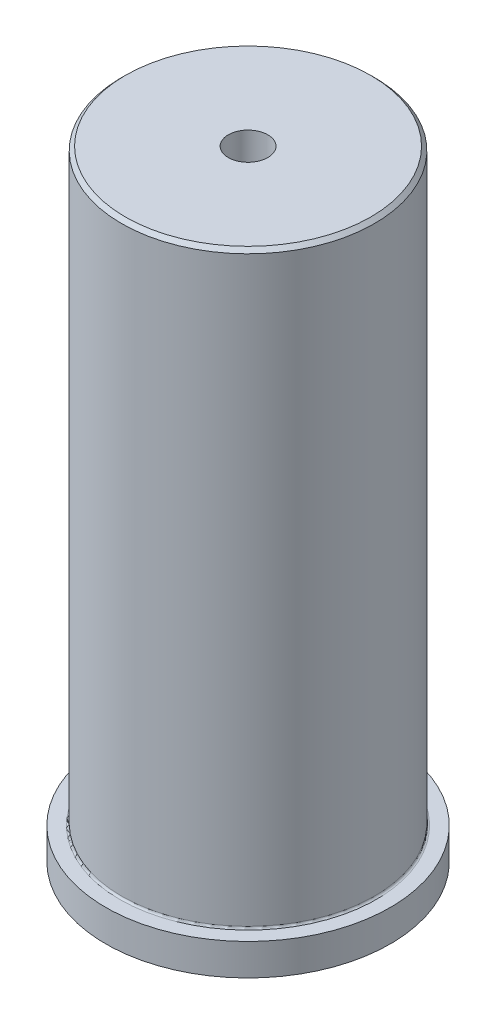
ISO-10303-21;
HEADER;
FILE_DESCRIPTION(('STEP AP214'),'2;1');
FILE_NAME('part.step','',(''),(''),'','','');
FILE_SCHEMA(('AUTOMOTIVE_DESIGN { 1 0 10303 214 1 1 1 1 }'));
ENDSEC;
DATA;
#1=APPLICATION_CONTEXT('core data for automotive mechanical design processes');
#2=APPLICATION_PROTOCOL_DEFINITION('international standard','automotive_design',2000,#1);
#3=PRODUCT_CONTEXT('',#1,'mechanical');
#4=PRODUCT('Part','Part','',(#3));
#5=PRODUCT_RELATED_PRODUCT_CATEGORY('part','',(#4));
#6=PRODUCT_DEFINITION_FORMATION('','',#4);
#7=PRODUCT_DEFINITION_CONTEXT('part definition',#1,'design');
#8=PRODUCT_DEFINITION('design','',#6,#7);
#9=PRODUCT_DEFINITION_SHAPE('','',#8);
#10=(LENGTH_UNIT() NAMED_UNIT(*) SI_UNIT(.MILLI.,.METRE.));
#11=(NAMED_UNIT(*) PLANE_ANGLE_UNIT() SI_UNIT($,.RADIAN.));
#12=(NAMED_UNIT(*) SI_UNIT($,.STERADIAN.) SOLID_ANGLE_UNIT());
#13=UNCERTAINTY_MEASURE_WITH_UNIT(LENGTH_MEASURE(1.E-05),#10,'distance_accuracy_value','');
#14=(GEOMETRIC_REPRESENTATION_CONTEXT(3) GLOBAL_UNCERTAINTY_ASSIGNED_CONTEXT((#13)) GLOBAL_UNIT_ASSIGNED_CONTEXT((#10,
#11,#12)) REPRESENTATION_CONTEXT('',''));
#15=CARTESIAN_POINT('',(0.,0.,0.));
#16=DIRECTION('',(0.,0.,1.));
#17=DIRECTION('',(1.,0.,0.));
#18=AXIS2_PLACEMENT_3D('',#15,#16,#17);
#19=CARTESIAN_POINT('',(0.,0.,0.));
#20=DIRECTION('',(0.,-1.,0.));
#21=DIRECTION('',(0.,0.,-1.));
#22=AXIS2_PLACEMENT_3D('',#19,#20,#21);
#23=PLANE('',#22);
#24=CARTESIAN_POINT('',(0.,0.,0.));
#25=DIRECTION('',(0.,-1.,0.));
#26=DIRECTION('',(0.,0.,-1.));
#27=AXIS2_PLACEMENT_3D('',#24,#25,#26);
#28=CIRCLE('',#27,28.575);
#29=CARTESIAN_POINT('',(0.,0.,-28.575));
#30=VERTEX_POINT('',#29);
#31=EDGE_CURVE('E83',#30,#30,#28,.T.);
#32=ORIENTED_EDGE('',*,*,#31,.T.);
#33=EDGE_LOOP('',(#32));
#34=FACE_BOUND('',#33,.T.);
#35=ADVANCED_FACE('F35',(#34),#23,.T.);
#36=CARTESIAN_POINT('',(0.,0.,0.));
#37=DIRECTION('',(0.,-1.,0.));
#38=DIRECTION('',(0.,0.,-1.));
#39=AXIS2_PLACEMENT_3D('',#36,#37,#38);
#40=CYLINDRICAL_SURFACE('',#39,28.575);
#41=CARTESIAN_POINT('',(0.,6.35,0.));
#42=DIRECTION('',(0.,-1.,0.));
#43=DIRECTION('',(0.,0.,-1.));
#44=AXIS2_PLACEMENT_3D('',#41,#42,#43);
#45=CIRCLE('',#44,28.575);
#46=CARTESIAN_POINT('',(0.,6.35,-28.575));
#47=VERTEX_POINT('',#46);
#48=EDGE_CURVE('E73',#47,#47,#45,.T.);
#49=ORIENTED_EDGE('',*,*,#48,.T.);
#50=EDGE_LOOP('',(#49));
#51=FACE_BOUND('',#50,.T.);
#52=ORIENTED_EDGE('',*,*,#31,.F.);
#53=EDGE_LOOP('',(#52));
#54=FACE_BOUND('',#53,.T.);
#55=ADVANCED_FACE('F108',(#51,#54),#40,.T.);
#56=CARTESIAN_POINT('',(28.575,6.35,0.));
#57=DIRECTION('',(0.,1.,0.));
#58=DIRECTION('',(0.,0.,1.));
#59=AXIS2_PLACEMENT_3D('',#56,#57,#58);
#60=PLANE('',#59);
#61=CARTESIAN_POINT('',(0.,6.35,0.));
#62=DIRECTION('',(0.,1.,0.));
#63=DIRECTION('',(0.,0.,1.));
#64=AXIS2_PLACEMENT_3D('',#61,#62,#63);
#65=CIRCLE('',#64,25.781);
#66=CARTESIAN_POINT('',(0.,6.35,25.781));
#67=VERTEX_POINT('',#66);
#68=EDGE_CURVE('E92',#67,#67,#65,.F.);
#69=ORIENTED_EDGE('',*,*,#68,.T.);
#70=EDGE_LOOP('',(#69));
#71=FACE_BOUND('',#70,.T.);
#72=ORIENTED_EDGE('',*,*,#48,.F.);
#73=EDGE_LOOP('',(#72));
#74=FACE_BOUND('',#73,.T.);
#75=ADVANCED_FACE('F105',(#71,#74),#60,.T.);
#76=CARTESIAN_POINT('',(0.,0.,0.));
#77=DIRECTION('',(0.,-1.,0.));
#78=DIRECTION('',(0.,0.,-1.));
#79=AXIS2_PLACEMENT_3D('',#76,#77,#78);
#80=CYLINDRICAL_SURFACE('',#79,25.4);
#81=CARTESIAN_POINT('',(0.,96.5073,-25.4));
#82=CARTESIAN_POINT('',(0.0890772815516551,96.5072960806031,-25.3999993405078));
#83=CARTESIAN_POINT('',(0.178216934422193,96.4997773935456,-25.3995264004062));
#84=CARTESIAN_POINT('',(0.354034892257721,96.4698917787592,-25.3976852164307));
#85=CARTESIAN_POINT('',(0.440710209847181,96.4475075690208,-25.3963159305306));
#86=CARTESIAN_POINT('',(0.609027315874058,96.3885363455029,-25.3928369579348));
#87=CARTESIAN_POINT('',(0.69067173322489,96.3519568237269,-25.3907276618579));
#88=CARTESIAN_POINT('',(0.846640273798179,96.2656454787975,-25.3860059056847));
#89=CARTESIAN_POINT('',(0.920966068158769,96.215916667762,-25.3833935608593));
#90=CARTESIAN_POINT('',(1.06032018908115,96.104636733557,-25.3779549712506));
#91=CARTESIAN_POINT('',(1.12533611013224,96.0430700874601,-25.375128448598));
#92=CARTESIAN_POINT('',(1.24411883695699,95.9098941153553,-25.3695824409509));
#93=CARTESIAN_POINT('',(1.29788517266755,95.838284369906,-25.3668629604329));
#94=CARTESIAN_POINT('',(1.3926807081512,95.6869847096737,-25.3618355765534));
#95=CARTESIAN_POINT('',(1.43369960395146,95.6072883269854,-25.3595280067842));
#96=CARTESIAN_POINT('',(1.50176994858076,95.4421230244906,-25.355588265541));
#97=CARTESIAN_POINT('',(1.52882154762219,95.356654166776,-25.3539560868034));
#98=CARTESIAN_POINT('',(1.56815497696011,95.1824895560097,-25.3515538346627));
#99=CARTESIAN_POINT('',(1.58045623796135,95.093798207093,-25.3507826271897));
#100=CARTESIAN_POINT('',(1.58999978541007,94.9156063978836,-25.3501858903591));
#101=CARTESIAN_POINT('',(1.58724224240966,94.826105946766,-25.3503603502911));
#102=CARTESIAN_POINT('',(1.56676258410163,94.6489689242994,-25.3516342215337));
#103=CARTESIAN_POINT('',(1.54906149613709,94.5613299112334,-25.3527323331487));
#104=CARTESIAN_POINT('',(1.49922983151612,94.3902695359763,-25.3557277104486));
#105=CARTESIAN_POINT('',(1.46709916840193,94.3068481990596,-25.3576249809218));
#106=CARTESIAN_POINT('',(1.38929655485215,94.1465236536905,-25.3620063610172));
#107=CARTESIAN_POINT('',(1.34361506586004,94.0696250858746,-25.3644908837608));
#108=CARTESIAN_POINT('',(1.24001444407503,93.9245796839926,-25.369766364796));
#109=CARTESIAN_POINT('',(1.18209517370326,93.8564329483295,-25.3725573265326));
#110=CARTESIAN_POINT('',(1.05554467500541,93.7307033049213,-25.378136933608));
#111=CARTESIAN_POINT('',(0.986895248611048,93.6731387119199,-25.3809255667683));
#112=CARTESIAN_POINT('',(0.840896941222836,93.5703486728836,-25.3861816554736));
#113=CARTESIAN_POINT('',(0.763548057189617,93.5251232311597,-25.3886491109065));
#114=CARTESIAN_POINT('',(0.602335379939374,93.4482968309815,-25.3929849946973));
#115=CARTESIAN_POINT('',(0.518471255288405,93.4166965661839,-25.3948533925561));
#116=CARTESIAN_POINT('',(0.346613655752569,93.3680297708484,-25.3977802081714));
#117=CARTESIAN_POINT('',(0.258620229105691,93.3509630705757,-25.3988386353874));
#118=CARTESIAN_POINT('',(0.0811607430297941,93.3318705596317,-25.4000250223717));
#119=CARTESIAN_POINT('',(-0.00830258207145954,93.3298194271945,-25.4001545486009));
#120=CARTESIAN_POINT('',(-0.186302024601945,93.34075011428,-25.3994727044321));
#121=CARTESIAN_POINT('',(-0.274838146853901,93.353731855572,-25.3986613389306));
#122=CARTESIAN_POINT('',(-0.448398631876102,93.3943388195394,-25.3961900592131));
#123=CARTESIAN_POINT('',(-0.533425723141905,93.4219524246147,-25.3945308182418));
#124=CARTESIAN_POINT('',(-0.697638751545767,93.4910274669384,-25.3905504582616));
#125=CARTESIAN_POINT('',(-0.776824636139441,93.5324890287372,-25.3882293332997));
#126=CARTESIAN_POINT('',(-0.927223409402576,93.6281475014472,-25.3831821134134));
#127=CARTESIAN_POINT('',(-0.998425523422202,93.682361324072,-25.3804554824989));
#128=CARTESIAN_POINT('',(-1.13072712197349,93.801960770328,-25.3749058995054));
#129=CARTESIAN_POINT('',(-1.19182650702397,93.8673465039557,-25.3720829464783));
#130=CARTESIAN_POINT('',(-1.3022740345212,94.0075429566602,-25.3666543507824));
#131=CARTESIAN_POINT('',(-1.35160574926768,94.0823666310783,-25.3640490151651));
#132=CARTESIAN_POINT('',(-1.43700521668147,94.2392498773811,-25.3593543494529));
#133=CARTESIAN_POINT('',(-1.47307305114239,94.321309404641,-25.357265016176));
#134=CARTESIAN_POINT('',(-1.53089247905071,94.4902749837596,-25.3538401885538));
#135=CARTESIAN_POINT('',(-1.55265441218913,94.5771774859353,-25.352504149859));
#136=CARTESIAN_POINT('',(-1.58127806496944,94.7534114841111,-25.3507350685755));
#137=CARTESIAN_POINT('',(-1.58813993249528,94.8427429559946,-25.3503020170246));
#138=CARTESIAN_POINT('',(-1.58676724213198,95.0211357473517,-25.3503879628329));
#139=CARTESIAN_POINT('',(-1.57855851143023,95.1101972674954,-25.3509053314138));
#140=CARTESIAN_POINT('',(-1.54733118630569,95.2856747860797,-25.3528303653629));
#141=CARTESIAN_POINT('',(-1.52431256504968,95.3720907797266,-25.3542380323443));
#142=CARTESIAN_POINT('',(-1.46412468021325,95.5398281239225,-25.3577846332053));
#143=CARTESIAN_POINT('',(-1.42695551825154,95.6211495110523,-25.3599235618336));
#144=CARTESIAN_POINT('',(-1.3395252161022,95.7764008560819,-25.3646916102891));
#145=CARTESIAN_POINT('',(-1.28926441503038,95.8503310053701,-25.3673207174186));
#146=CARTESIAN_POINT('',(-1.17698211995936,95.9888322094471,-25.3727781000682));
#147=CARTESIAN_POINT('',(-1.11494196278718,96.0533881213252,-25.3756066871117));
#148=CARTESIAN_POINT('',(-0.980886959107157,96.1711911511266,-25.3811416437811));
#149=CARTESIAN_POINT('',(-0.908869675832013,96.2244354982923,-25.3838479833349));
#150=CARTESIAN_POINT('',(-0.756822725724815,96.318143200095,-25.3888362949521));
#151=CARTESIAN_POINT('',(-0.676783256004449,96.3585906602565,-25.3911177378344));
#152=CARTESIAN_POINT('',(-0.511093256064827,96.4254234449966,-25.3949920704623));
#153=CARTESIAN_POINT('',(-0.425449430168753,96.4518252387231,-25.396585766205));
#154=CARTESIAN_POINT('',(-0.282734715561966,96.4829552499224,-25.398487400356));
#155=CARTESIAN_POINT('',(-0.226586319292563,96.4920727261902,-25.3990521043383));
#156=CARTESIAN_POINT('',(-0.113633743516228,96.5042463472882,-25.3998086142742));
#157=CARTESIAN_POINT('',(-0.0568295649160699,96.5073025004986,-25.4000004207432));
#158=CARTESIAN_POINT('',(0.,96.5073,-25.4));
#159=B_SPLINE_CURVE_WITH_KNOTS('',3,(#81,#82,#83,#84,#85,#86,#87,#88,#89,#90,#91,#92,#93,#94,
#95,#96,#97,#98,#99,#100,#101,#102,#103,#104,#105,#106,#107,#108,#109,#110,#111,#112,#113,#114,
#115,#116,#117,#118,#119,#120,#121,#122,#123,#124,#125,#126,#127,#128,#129,#130,#131,#132,#133,
#134,#135,#136,#137,#138,#139,#140,#141,#142,#143,#144,#145,#146,#147,#148,#149,#150,#151,#152,
#153,#154,#155,#156,#157,#158),.UNSPECIFIED.,.T.,.F.,(4,2,2,2,2,2,2,2,2,2,2,2,2,2,2,2,2,2,2,2,2,
2,2,2,2,2,2,2,2,2,2,2,2,2,2,2,2,2,4),(0.,0.267024382982193,0.534359741586169,0.801554197373604,
1.06868749966621,1.33617351212228,1.60367069923104,1.87138354982984,2.13909352122966,
2.40645044796103,2.6738043466833,2.94078267254129,3.20776259807606,3.47493090110761,
3.74210220784267,4.0097316476512,4.27736118096278,4.54500433766488,4.81264436857103,
5.07983295582914,5.34702015264969,5.6139955218429,5.88097329231165,6.14830713797552,
6.41564361590886,6.6833511403882,6.95105701398333,7.21856918791958,7.48607870677128,
7.75313020994782,8.02018219698156,8.2872322662816,8.55427541880832,8.82174525868233,
9.08928053970249,9.35714682225784,9.62469832393475,9.79505489772018,9.9654112359753),.UNSPECIFIED.);
#160=CARTESIAN_POINT('',(0.,96.5073,-25.4));
#161=VERTEX_POINT('',#160);
#162=EDGE_CURVE('E67',#161,#161,#159,.T.);
#163=ORIENTED_EDGE('',*,*,#162,.F.);
#164=EDGE_LOOP('',(#163));
#165=FACE_BOUND('',#164,.T.);
#166=CARTESIAN_POINT('',(0.,6.731,0.));
#167=DIRECTION('',(0.,1.,0.));
#168=DIRECTION('',(0.,0.,1.));
#169=AXIS2_PLACEMENT_3D('',#166,#167,#168);
#170=CIRCLE('',#169,25.4);
#171=CARTESIAN_POINT('',(0.,6.731,25.4));
#172=VERTEX_POINT('',#171);
#173=EDGE_CURVE('E48',#172,#172,#170,.T.);
#174=ORIENTED_EDGE('',*,*,#173,.T.);
#175=EDGE_LOOP('',(#174));
#176=FACE_BOUND('',#175,.T.);
#177=CARTESIAN_POINT('',(0.,123.698,0.));
#178=DIRECTION('',(0.,1.,0.));
#179=DIRECTION('',(0.,0.,1.));
#180=AXIS2_PLACEMENT_3D('',#177,#178,#179);
#181=CIRCLE('',#180,25.4);
#182=CARTESIAN_POINT('',(0.,123.698,25.4));
#183=VERTEX_POINT('',#182);
#184=EDGE_CURVE('E86',#183,#183,#181,.F.);
#185=ORIENTED_EDGE('',*,*,#184,.T.);
#186=EDGE_LOOP('',(#185));
#187=FACE_BOUND('',#186,.T.);
#188=ADVANCED_FACE('F97',(#165,#176,#187),#80,.T.);
#189=CARTESIAN_POINT('',(25.4,124.46,0.));
#190=DIRECTION('',(0.,1.,0.));
#191=DIRECTION('',(0.,0.,1.));
#192=AXIS2_PLACEMENT_3D('',#189,#190,#191);
#193=PLANE('',#192);
#194=CARTESIAN_POINT('',(0.,124.46,0.));
#195=DIRECTION('',(0.,1.,0.));
#196=DIRECTION('',(0.,0.,1.));
#197=AXIS2_PLACEMENT_3D('',#194,#195,#196);
#198=CIRCLE('',#197,24.638);
#199=CARTESIAN_POINT('',(0.,124.46,24.638));
#200=VERTEX_POINT('',#199);
#201=EDGE_CURVE('E89',#200,#200,#198,.T.);
#202=ORIENTED_EDGE('',*,*,#201,.T.);
#203=EDGE_LOOP('',(#202));
#204=FACE_BOUND('',#203,.T.);
#205=CARTESIAN_POINT('',(0.,124.46,0.));
#206=DIRECTION('',(0.,1.,0.));
#207=DIRECTION('',(0.,0.,1.));
#208=AXIS2_PLACEMENT_3D('',#205,#206,#207);
#209=CIRCLE('',#208,3.96875);
#210=CARTESIAN_POINT('',(0.,124.46,3.96875));
#211=VERTEX_POINT('',#210);
#212=EDGE_CURVE('E70',#211,#211,#209,.T.);
#213=ORIENTED_EDGE('',*,*,#212,.F.);
#214=EDGE_LOOP('',(#213));
#215=FACE_BOUND('',#214,.T.);
#216=ADVANCED_FACE('F130',(#204,#215),#193,.T.);
#217=CARTESIAN_POINT('',(0.,124.46,0.));
#218=DIRECTION('',(0.,1.,0.));
#219=DIRECTION('',(0.,0.,1.));
#220=AXIS2_PLACEMENT_3D('',#217,#218,#219);
#221=CYLINDRICAL_SURFACE('',#220,3.96874999999999);
#222=CARTESIAN_POINT('',(0.,94.9198,0.));
#223=DIRECTION('',(0.,1.,0.));
#224=DIRECTION('',(0.,0.,1.));
#225=AXIS2_PLACEMENT_3D('',#222,#223,#224);
#226=CIRCLE('',#225,3.96874999999999);
#227=CARTESIAN_POINT('',(-1.5875,94.9198,-3.63741945787119));
#228=VERTEX_POINT('',#227);
#229=CARTESIAN_POINT('',(1.58750000000522,94.9198000000011,-3.63741945787102));
#230=VERTEX_POINT('',#229);
#231=EDGE_CURVE('E66',#228,#230,#226,.T.);
#232=ORIENTED_EDGE('',*,*,#231,.F.);
#233=CARTESIAN_POINT('',(-1.5875,94.9198,-3.63741945787119));
#234=CARTESIAN_POINT('',(-1.58750184763796,94.9625202346042,-3.63741384116569));
#235=CARTESIAN_POINT('',(-1.58577445725726,95.0052179154992,-3.63817300640441));
#236=CARTESIAN_POINT('',(-1.5788972457707,95.0902688017805,-3.64116482543655));
#237=CARTESIAN_POINT('',(-1.5737487281427,95.1326221321483,-3.64339691803017));
#238=CARTESIAN_POINT('',(-1.55328918259186,95.2583622530961,-3.65219121167938));
#239=CARTESIAN_POINT('',(-1.53296334513986,95.3408444249451,-3.66085250980029));
#240=CARTESIAN_POINT('',(-1.47975219669445,95.5008384251617,-3.68267874856404));
#241=CARTESIAN_POINT('',(-1.44687994191611,95.5783553229549,-3.69583900596163));
#242=CARTESIAN_POINT('',(-1.36960446697949,95.7268641978761,-3.72516643919592));
#243=CARTESIAN_POINT('',(-1.32519028478491,95.7978498846767,-3.74133646942275));
#244=CARTESIAN_POINT('',(-1.22342052482457,95.9352195124498,-3.77587682796575));
#245=CARTESIAN_POINT('',(-1.16551775760605,96.0011803160198,-3.79431748869476));
#246=CARTESIAN_POINT('',(-1.03957181378558,96.1227587532036,-3.83073898600911));
#247=CARTESIAN_POINT('',(-0.971526560525773,96.1783742633806,-3.84871972754133));
#248=CARTESIAN_POINT('',(-0.823917119447146,96.2798167046786,-3.8830521343278));
#249=CARTESIAN_POINT('',(-0.744004028111115,96.3251700437921,-3.89931136026915));
#250=CARTESIAN_POINT('',(-0.576916682442305,96.4016073812985,-3.92750630353857));
#251=CARTESIAN_POINT('',(-0.489745476569413,96.4326973350523,-3.93944382485891));
#252=CARTESIAN_POINT('',(-0.315092901861091,96.478202103794,-3.95714787330028));
#253=CARTESIAN_POINT('',(-0.227830898279668,96.493351399034,-3.96318519792086));
#254=CARTESIAN_POINT('',(-0.0518068179224114,96.5089100992066,-3.96938746202448));
#255=CARTESIAN_POINT('',(0.0369547162815052,96.509324725921,-3.96955448186965));
#256=CARTESIAN_POINT('',(0.208147742687057,96.4958042480781,-3.96416180790797));
#257=CARTESIAN_POINT('',(0.290654742072088,96.4826738696479,-3.95892326059756));
#258=CARTESIAN_POINT('',(0.452179361702801,96.4438052168308,-3.943741084116));
#259=CARTESIAN_POINT('',(0.531196784191863,96.4180662289028,-3.93379718866281));
#260=CARTESIAN_POINT('',(0.684924921659605,96.354394939835,-3.9099873428814));
#261=CARTESIAN_POINT('',(0.759552750778175,96.3162846651395,-3.89606452462549));
#262=CARTESIAN_POINT('',(0.901547178669673,96.2291187327698,-3.86567840343788));
#263=CARTESIAN_POINT('',(0.968911217689372,96.1800592351741,-3.84921420986529));
#264=CARTESIAN_POINT('',(1.0991559429862,96.0686386819294,-3.81414165054779));
#265=CARTESIAN_POINT('',(1.16145286432769,96.0056162857332,-3.79546347818484));
#266=CARTESIAN_POINT('',(1.27484128841413,95.8699345494739,-3.75889798276558));
#267=CARTESIAN_POINT('',(1.32592768619011,95.797270843087,-3.74101102295394));
#268=CARTESIAN_POINT('',(1.41679340984813,95.6417392120589,-3.70757203029471));
#269=CARTESIAN_POINT('',(1.45620527447741,95.5586379109011,-3.69210194832025));
#270=CARTESIAN_POINT('',(1.52020030571075,95.3862380399839,-3.66622095891042));
#271=CARTESIAN_POINT('',(1.54480971201752,95.2969507511752,-3.6558011055531));
#272=CARTESIAN_POINT('',(1.57012149324166,95.1589222403871,-3.64496590926534));
#273=CARTESIAN_POINT('',(1.57662963475496,95.1113655702421,-3.64214916158917));
#274=CARTESIAN_POINT('',(1.585319426699,95.0158159536723,-3.63837172624545));
#275=CARTESIAN_POINT('',(1.5875037430755,94.9678232944172,-3.63740989489947));
#276=CARTESIAN_POINT('',(1.5875,94.9198,-3.63741945787119));
#277=B_SPLINE_CURVE_WITH_KNOTS('',3,(#233,#234,#235,#236,#237,#238,#239,#240,#241,#242,#243,
#244,#245,#246,#247,#248,#249,#250,#251,#252,#253,#254,#255,#256,#257,#258,#259,#260,#261,#262,
#263,#264,#265,#266,#267,#268,#269,#270,#271,#272,#273,#274,#275,#276),.UNSPECIFIED.,.F.,.F.,(4,
2,2,2,2,2,2,2,2,2,2,2,2,2,2,2,2,2,2,2,2,4),(0.,0.128075414647193,0.25610205945729,
0.510926615943885,0.765486713444776,1.02028947067145,1.28816908677863,1.5561036263442,
1.83462477353762,2.11302952431811,2.37795472556701,2.64278603971195,2.89274159568693,
3.142711298678,3.39644948517677,3.6502767985577,3.92075071104839,4.19134753562058,
4.46972699810529,4.74761152332686,4.89165235924199,5.03560435603824),.UNSPECIFIED.);
#278=EDGE_CURVE('E54',#228,#230,#277,.T.);
#279=ORIENTED_EDGE('',*,*,#278,.T.);
#280=EDGE_LOOP('',(#232,#279));
#281=FACE_BOUND('',#280,.T.);
#282=ORIENTED_EDGE('',*,*,#212,.T.);
#283=EDGE_LOOP('',(#282));
#284=FACE_BOUND('',#283,.T.);
#285=ADVANCED_FACE('F64',(#281,#284),#221,.F.);
#286=CARTESIAN_POINT('',(0.,94.9198,0.));
#287=DIRECTION('',(0.,1.,0.));
#288=DIRECTION('',(0.,0.,1.));
#289=AXIS2_PLACEMENT_3D('',#286,#287,#288);
#290=CONICAL_SURFACE('',#289,3.96874999999999,1.02974425867666);
#291=CARTESIAN_POINT('',(0.,92.5351344182344,0.));
#292=VERTEX_POINT('',#291);
#293=VERTEX_LOOP('',#292);
#294=FACE_BOUND('',#293,.T.);
#295=ORIENTED_EDGE('',*,*,#231,.T.);
#296=CARTESIAN_POINT('',(1.5795224428605,95.07875,-3.9275729873559));
#297=CARTESIAN_POINT('',(1.58344333677814,95.0397022355841,-3.85595249194583));
#298=CARTESIAN_POINT('',(1.58593141697278,95.0005250898184,-3.78432182544267));
#299=CARTESIAN_POINT('',(1.58798793225085,94.9219058753614,-3.64114625421526));
#300=CARTESIAN_POINT('',(1.58755579799207,94.882463756507,-3.56960136893508));
#301=CARTESIAN_POINT('',(1.5837009017317,94.8030063684412,-3.42615868035616));
#302=CARTESIAN_POINT('',(1.58025418698883,94.7629890394113,-3.35426264730595));
#303=CARTESIAN_POINT('',(1.57021390550269,94.6826873657658,-3.21084463354398));
#304=CARTESIAN_POINT('',(1.56362054983504,94.6424030392391,-3.13932262806788));
#305=CARTESIAN_POINT('',(1.54663243760234,94.5592652568942,-2.99280587778499));
#306=CARTESIAN_POINT('',(1.53604427187384,94.5163950342645,-2.9178427541052));
#307=CARTESIAN_POINT('',(1.51081479443139,94.4303024900321,-2.76880787563595));
#308=CARTESIAN_POINT('',(1.49617392502911,94.3870802073524,-2.69473602449314));
#309=CARTESIAN_POINT('',(1.46240393589159,94.3003730760592,-2.54809599550866));
#310=CARTESIAN_POINT('',(1.44328915890449,94.2568894903547,-2.47552380261959));
#311=CARTESIAN_POINT('',(1.39985333866324,94.1694993642505,-2.3322400511732));
#312=CARTESIAN_POINT('',(1.37553550222514,94.1255931002081,-2.26152737654239));
#313=CARTESIAN_POINT('',(1.33093405651333,94.0538770052492,-2.14883787234815));
#314=CARTESIAN_POINT('',(1.31255360316518,94.0262009409726,-2.10602273531299));
#315=CARTESIAN_POINT('',(1.27298960396979,93.9706860226888,-2.02178384234232));
#316=CARTESIAN_POINT('',(1.25180533307891,93.9428471283609,-1.98036044978607));
#317=CARTESIAN_POINT('',(1.20636959191576,93.8872750533904,-1.8996604044695));
#318=CARTESIAN_POINT('',(1.18214099204808,93.8595425277239,-1.86037058626374));
#319=CARTESIAN_POINT('',(1.13001616396487,93.8041543750246,-1.78427175742645));
#320=CARTESIAN_POINT('',(1.10212207755077,93.776498712642,-1.74746131690919));
#321=CARTESIAN_POINT('',(1.03384318646687,93.7139730578907,-1.66744625258198));
#322=CARTESIAN_POINT('',(0.99213146310179,93.6792064718599,-1.62525989131106));
#323=CARTESIAN_POINT('',(0.900987402800761,93.6115259313846,-1.5484782642105));
#324=CARTESIAN_POINT('',(0.851571787988688,93.578608169587,-1.5138669382015));
#325=CARTESIAN_POINT('',(0.744651653391781,93.51641615137,-1.45385044862119));
#326=CARTESIAN_POINT('',(0.687085237285077,93.4871733485329,-1.42852161465669));
#327=CARTESIAN_POINT('',(0.565850518509586,93.435103050628,-1.38758694511125));
#328=CARTESIAN_POINT('',(0.502173242667169,93.4122851893411,-1.37199566817514));
#329=CARTESIAN_POINT('',(0.376939813886653,93.3764431517268,-1.34954265365589));
#330=CARTESIAN_POINT('',(0.315684587587442,93.362737373646,-1.34203712076897));
#331=CARTESIAN_POINT('',(0.191593478223792,93.3426491728459,-1.33155667696979));
#332=CARTESIAN_POINT('',(0.128756427932496,93.3362723302549,-1.32858521766162));
#333=CARTESIAN_POINT('',(-0.00988321503827012,93.3305289397429,-1.32585823660372));
#334=CARTESIAN_POINT('',(-0.0857733021383022,93.3328133247543,-1.32686190470749));
#335=CARTESIAN_POINT('',(-0.236195779028807,93.3481539141181,-1.33438454701499));
#336=CARTESIAN_POINT('',(-0.310728716470303,93.3612056704299,-1.3409012437946));
#337=CARTESIAN_POINT('',(-0.445204760789985,93.3946764112255,-1.36067981023971));
#338=CARTESIAN_POINT('',(-0.505659057876065,93.4136962212292,-1.37278295001192));
#339=CARTESIAN_POINT('',(-0.621941348234095,93.4578838376049,-1.40495598443121));
#340=CARTESIAN_POINT('',(-0.677779302184577,93.4830379185241,-1.4250081549001));
#341=CARTESIAN_POINT('',(-0.783244722178637,93.5376910641141,-1.47372331945847));
#342=CARTESIAN_POINT('',(-0.832869199888069,93.5671922047429,-1.50239043449032));
#343=CARTESIAN_POINT('',(-0.925247706605188,93.6286131768224,-1.56727374659057));
#344=CARTESIAN_POINT('',(-0.967988626473824,93.6605374568009,-1.60350405285653));
#345=CARTESIAN_POINT('',(-1.06875901107863,93.74326618662,-1.70323239040623));
#346=CARTESIAN_POINT('',(-1.12219291326876,93.7947591281459,-1.77073809040139));
#347=CARTESIAN_POINT('',(-1.21682025127589,93.8978330761605,-1.9138172219525));
#348=CARTESIAN_POINT('',(-1.25796667518008,93.9494136802722,-1.98942017271155));
#349=CARTESIAN_POINT('',(-1.33191503149632,94.0535751795032,-2.14765170317834));
#350=CARTESIAN_POINT('',(-1.36442712079698,94.1061391788078,-2.23042357480777));
#351=CARTESIAN_POINT('',(-1.4215583917611,94.2106641453072,-2.39907040773328));
#352=CARTESIAN_POINT('',(-1.44616904697799,94.2626244031386,-2.48494861066656));
#353=CARTESIAN_POINT('',(-1.48884516005726,94.3660599928942,-2.65879718697581));
#354=CARTESIAN_POINT('',(-1.50689854972569,94.4175342625738,-2.74677110358676));
#355=CARTESIAN_POINT('',(-1.5372562029899,94.5199865587711,-2.92399952534186));
#356=CARTESIAN_POINT('',(-1.54955881511596,94.5709644386287,-3.01325439076508));
#357=CARTESIAN_POINT('',(-1.57408479065891,94.699227386911,-3.23983006679684));
#358=CARTESIAN_POINT('',(-1.58285187080979,94.7762230851955,-3.37770098044201));
#359=CARTESIAN_POINT('',(-1.58768327234834,94.890637202955,-3.58442004763735));
#360=CARTESIAN_POINT('',(-1.58792448012629,94.9284279239432,-3.65300389474136));
#361=CARTESIAN_POINT('',(-1.5857250097563,95.0037675219856,-3.79024912803767));
#362=CARTESIAN_POINT('',(-1.58328470702933,95.0413164321538,-3.85891050203164));
#363=CARTESIAN_POINT('',(-1.5795224428605,95.07875,-3.9275729873559));
#364=B_SPLINE_CURVE_WITH_KNOTS('',3,(#296,#297,#298,#299,#300,#301,#302,#303,#304,#305,#306,
#307,#308,#309,#310,#311,#312,#313,#314,#315,#316,#317,#318,#319,#320,#321,#322,#323,#324,#325,
#326,#327,#328,#329,#330,#331,#332,#333,#334,#335,#336,#337,#338,#339,#340,#341,#342,#343,#344,
#345,#346,#347,#348,#349,#350,#351,#352,#353,#354,#355,#356,#357,#358,#359,#360,#361,#362,#363),
.UNSPECIFIED.,.F.,.F.,(4,2,2,2,2,2,2,2,2,2,2,2,2,2,2,2,2,2,2,2,2,2,2,2,2,2,2,2,2,2,2,2,2,4),(0.,
0.244992955164347,0.490033676975548,0.737039272381084,0.984028301062582,1.24494616632408,
1.50583556625604,1.76589977661822,2.02580416024274,2.18831221692593,2.35086237923117,
2.51225721005284,2.67355815122775,2.87913374819788,3.08426917948316,3.29105546981577,
3.49815019133188,3.68714719380249,3.87628800027904,4.10313426948868,4.32988687456873,
4.52261803310111,4.71492184911178,4.90731780010719,5.10007592720674,5.39930606289558,
5.69966680253251,6.00910709669435,6.31888019457905,6.62922055371335,6.93964997964126,
7.41362161975978,7.64850602017114,7.88335754012332),.UNSPECIFIED.);
#365=EDGE_CURVE('E11',#230,#228,#364,.T.);
#366=ORIENTED_EDGE('',*,*,#365,.T.);
#367=EDGE_LOOP('',(#295,#366));
#368=FACE_BOUND('',#367,.T.);
#369=ADVANCED_FACE('F69',(#294,#368),#290,.F.);
#370=CARTESIAN_POINT('',(0.,123.698,0.));
#371=DIRECTION('',(0.,-1.,0.));
#372=DIRECTION('',(0.,0.,-1.));
#373=AXIS2_PLACEMENT_3D('',#370,#371,#372);
#374=CONICAL_SURFACE('',#373,25.4,0.785398163397444);
#375=ORIENTED_EDGE('',*,*,#201,.F.);
#376=EDGE_LOOP('',(#375));
#377=FACE_BOUND('',#376,.T.);
#378=ORIENTED_EDGE('',*,*,#184,.F.);
#379=EDGE_LOOP('',(#378));
#380=FACE_BOUND('',#379,.T.);
#381=ADVANCED_FACE('F102',(#377,#380),#374,.T.);
#382=CARTESIAN_POINT('',(0.,6.731,0.));
#383=DIRECTION('',(0.,1.,0.));
#384=DIRECTION('',(0.,0.,1.));
#385=AXIS2_PLACEMENT_3D('',#382,#383,#384);
#386=TOROIDAL_SURFACE('',#385,25.781,0.381);
#387=ORIENTED_EDGE('',*,*,#173,.F.);
#388=EDGE_LOOP('',(#387));
#389=FACE_BOUND('',#388,.T.);
#390=ORIENTED_EDGE('',*,*,#68,.F.);
#391=EDGE_LOOP('',(#390));
#392=FACE_BOUND('',#391,.T.);
#393=ADVANCED_FACE('F37',(#389,#392),#386,.F.);
#394=CARTESIAN_POINT('',(0.,94.9198,-27.94));
#395=DIRECTION('',(0.,0.,1.));
#396=DIRECTION('',(1.,0.,0.));
#397=AXIS2_PLACEMENT_3D('',#394,#395,#396);
#398=CYLINDRICAL_SURFACE('',#397,1.5875);
#399=ORIENTED_EDGE('',*,*,#162,.T.);
#400=EDGE_LOOP('',(#399));
#401=FACE_BOUND('',#400,.T.);
#402=ORIENTED_EDGE('',*,*,#365,.F.);
#403=ORIENTED_EDGE('',*,*,#278,.F.);
#404=EDGE_LOOP('',(#402,#403));
#405=FACE_BOUND('',#404,.T.);
#406=ADVANCED_FACE('F59',(#401,#405),#398,.F.);
#407=CLOSED_SHELL('',(#35,#55,#75,#188,#216,#285,#369,#381,#393,#406));
#408=MANIFOLD_SOLID_BREP('B2',#407);
#409=ADVANCED_BREP_SHAPE_REPRESENTATION('',(#18,#408),#14);
#410=SHAPE_DEFINITION_REPRESENTATION(#9,#409);
ENDSEC;
END-ISO-10303-21;
